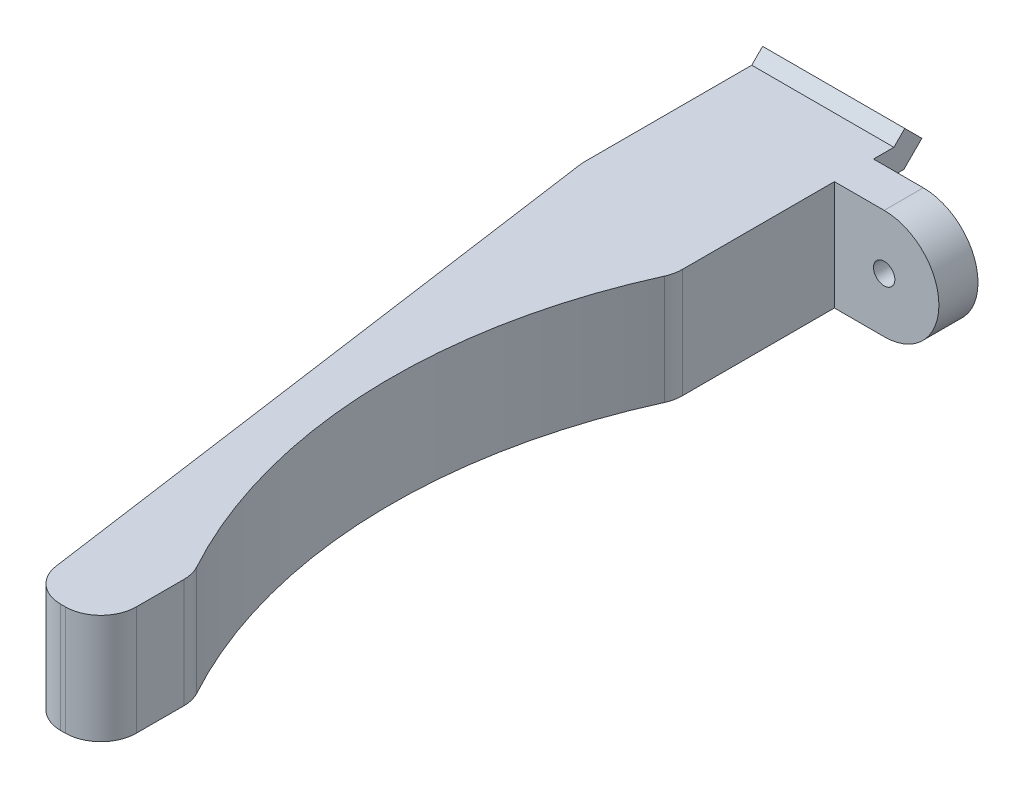
ISO-10303-21;
HEADER;
FILE_DESCRIPTION(('STEP AP214'),'2;1');
FILE_NAME('part.step','',(''),(''),'','','');
FILE_SCHEMA(('AUTOMOTIVE_DESIGN { 1 0 10303 214 1 1 1 1 }'));
ENDSEC;
DATA;
#1=APPLICATION_CONTEXT('core data for automotive mechanical design processes');
#2=APPLICATION_PROTOCOL_DEFINITION('international standard','automotive_design',2000,#1);
#3=PRODUCT_CONTEXT('',#1,'mechanical');
#4=PRODUCT('Part','Part','',(#3));
#5=PRODUCT_RELATED_PRODUCT_CATEGORY('part','',(#4));
#6=PRODUCT_DEFINITION_FORMATION('','',#4);
#7=PRODUCT_DEFINITION_CONTEXT('part definition',#1,'design');
#8=PRODUCT_DEFINITION('design','',#6,#7);
#9=PRODUCT_DEFINITION_SHAPE('','',#8);
#10=(LENGTH_UNIT() NAMED_UNIT(*) SI_UNIT(.MILLI.,.METRE.));
#11=(NAMED_UNIT(*) PLANE_ANGLE_UNIT() SI_UNIT($,.RADIAN.));
#12=(NAMED_UNIT(*) SI_UNIT($,.STERADIAN.) SOLID_ANGLE_UNIT());
#13=UNCERTAINTY_MEASURE_WITH_UNIT(LENGTH_MEASURE(1.E-05),#10,'distance_accuracy_value','');
#14=(GEOMETRIC_REPRESENTATION_CONTEXT(3) GLOBAL_UNCERTAINTY_ASSIGNED_CONTEXT((#13)) GLOBAL_UNIT_ASSIGNED_CONTEXT((#10,
#11,#12)) REPRESENTATION_CONTEXT('',''));
#15=CARTESIAN_POINT('',(0.,0.,0.));
#16=DIRECTION('',(0.,0.,1.));
#17=DIRECTION('',(1.,0.,0.));
#18=AXIS2_PLACEMENT_3D('',#15,#16,#17);
#19=CARTESIAN_POINT('',(5.,-5.8181568544759,5.));
#20=DIRECTION('',(-1.,0.,0.));
#21=DIRECTION('',(0.,0.,1.));
#22=AXIS2_PLACEMENT_3D('',#19,#20,#21);
#23=PLANE('',#22);
#24=DIRECTION('',(0.,0.,1.));
#25=VECTOR('',#24,1.);
#26=CARTESIAN_POINT('',(5.,5.770255584937,-0.149999999997353));
#27=LINE('',#26,#25);
#28=CARTESIAN_POINT('',(5.,5.770255584937,-1.43370490960713));
#29=VERTEX_POINT('',#28);
#30=CARTESIAN_POINT('',(5.,5.770255584937,0.));
#31=VERTEX_POINT('',#30);
#32=EDGE_CURVE('E325',#29,#31,#27,.T.);
#33=ORIENTED_EDGE('',*,*,#32,.T.);
#34=DIRECTION('',(0.,-1.,0.));
#35=VECTOR('',#34,1.);
#36=CARTESIAN_POINT('',(5.,-1.92974441506292,0.));
#37=LINE('',#36,#35);
#38=CARTESIAN_POINT('',(5.,4.07025558493702,0.));
#39=VERTEX_POINT('',#38);
#40=EDGE_CURVE('E213',#31,#39,#37,.T.);
#41=ORIENTED_EDGE('',*,*,#40,.T.);
#42=DIRECTION('',(0.,-1.27213054907211E-13,-1.));
#43=VECTOR('',#42,1.);
#44=CARTESIAN_POINT('',(5.,4.07025558493702,0.));
#45=LINE('',#44,#43);
#46=CARTESIAN_POINT('',(5.,4.070255584937,-2.13786796564139));
#47=VERTEX_POINT('',#46);
#48=EDGE_CURVE('E298',#39,#47,#45,.T.);
#49=ORIENTED_EDGE('',*,*,#48,.T.);
#50=DIRECTION('',(0.,0.707106781186548,-0.707106781186547));
#51=VECTOR('',#50,1.);
#52=CARTESIAN_POINT('',(5.,5.3344691473101,-3.40208152801448));
#53=LINE('',#52,#51);
#54=CARTESIAN_POINT('',(5.,5.3344691473101,-3.40208152801448));
#55=VERTEX_POINT('',#54);
#56=EDGE_CURVE('E296',#47,#55,#53,.T.);
#57=ORIENTED_EDGE('',*,*,#56,.T.);
#58=DIRECTION('',(0.,0.707106781186546,0.707106781186549));
#59=VECTOR('',#58,1.);
#60=CARTESIAN_POINT('',(5.,6.53655067532722,-2.19999999999735));
#61=LINE('',#60,#59);
#62=CARTESIAN_POINT('',(5.,6.53655067532722,-2.19999999999735));
#63=VERTEX_POINT('',#62);
#64=EDGE_CURVE('E293',#55,#63,#61,.T.);
#65=ORIENTED_EDGE('',*,*,#64,.T.);
#66=DIRECTION('',(0.,-0.707106781186548,0.707106781186547));
#67=VECTOR('',#66,1.);
#68=CARTESIAN_POINT('',(5.,5.770255584937,-1.43370490960713));
#69=LINE('',#68,#67);
#70=EDGE_CURVE('E291',#63,#29,#69,.T.);
#71=ORIENTED_EDGE('',*,*,#70,.T.);
#72=EDGE_LOOP('',(#33,#41,#49,#57,#65,#71));
#73=FACE_BOUND('',#72,.T.);
#74=ADVANCED_FACE('F34',(#73),#23,.F.);
#75=DIRECTION('',(0.,0.,1.));
#76=VECTOR('',#75,1.);
#77=CARTESIAN_POINT('',(5.,-0.229744415063001,-0.149999999997353));
#78=LINE('',#77,#76);
#79=CARTESIAN_POINT('',(5.,-0.229744415063001,-1.43370490960713));
#80=VERTEX_POINT('',#79);
#81=CARTESIAN_POINT('',(5.,-0.229744415063001,0.));
#82=VERTEX_POINT('',#81);
#83=EDGE_CURVE('E210',#80,#82,#78,.T.);
#84=ORIENTED_EDGE('',*,*,#83,.T.);
#85=CARTESIAN_POINT('',(5.,-1.92974441506292,0.));
#86=VERTEX_POINT('',#85);
#87=EDGE_CURVE('E207',#82,#86,#37,.T.);
#88=ORIENTED_EDGE('',*,*,#87,.T.);
#89=DIRECTION('',(0.,0.,-1.));
#90=VECTOR('',#89,1.);
#91=CARTESIAN_POINT('',(5.,-1.929744415063,-0.149999999997353));
#92=LINE('',#91,#90);
#93=CARTESIAN_POINT('',(5.,-1.929744415063,-2.13786796564139));
#94=VERTEX_POINT('',#93);
#95=EDGE_CURVE('E190',#86,#94,#92,.T.);
#96=ORIENTED_EDGE('',*,*,#95,.T.);
#97=DIRECTION('',(0.,0.707106781186549,-0.707106781186546));
#98=VECTOR('',#97,1.);
#99=CARTESIAN_POINT('',(5.,-0.665530852689905,-3.40208152801448));
#100=LINE('',#99,#98);
#101=CARTESIAN_POINT('',(5.,-0.665530852689905,-3.40208152801448));
#102=VERTEX_POINT('',#101);
#103=EDGE_CURVE('E203',#94,#102,#100,.T.);
#104=ORIENTED_EDGE('',*,*,#103,.T.);
#105=DIRECTION('',(0.,0.707106781186548,0.707106781186548));
#106=VECTOR('',#105,1.);
#107=CARTESIAN_POINT('',(5.,0.536550675327224,-2.19999999999735));
#108=LINE('',#107,#106);
#109=CARTESIAN_POINT('',(5.,0.536550675327225,-2.19999999999735));
#110=VERTEX_POINT('',#109);
#111=EDGE_CURVE('E264',#102,#110,#108,.T.);
#112=ORIENTED_EDGE('',*,*,#111,.T.);
#113=DIRECTION('',(0.,-0.707106781186546,0.707106781186549));
#114=VECTOR('',#113,1.);
#115=CARTESIAN_POINT('',(5.,-0.229744415063001,-1.43370490960713));
#116=LINE('',#115,#114);
#117=EDGE_CURVE('E262',#110,#80,#116,.T.);
#118=ORIENTED_EDGE('',*,*,#117,.T.);
#119=EDGE_LOOP('',(#84,#88,#96,#104,#112,#118));
#120=FACE_BOUND('',#119,.T.);
#121=ADVANCED_FACE('F208',(#120),#23,.F.);
#122=CARTESIAN_POINT('',(5.,5.770255584937,2.75000000000266));
#123=VERTEX_POINT('',#122);
#124=CARTESIAN_POINT('',(5.,5.770255584937,13.4501334916828));
#125=VERTEX_POINT('',#124);
#126=EDGE_CURVE('E300',#123,#125,#27,.T.);
#127=ORIENTED_EDGE('',*,*,#126,.T.);
#128=DIRECTION('',(0.,-1.,0.));
#129=VECTOR('',#128,1.);
#130=CARTESIAN_POINT('',(5.,-1.92974441506298,13.4501334916828));
#131=LINE('',#130,#129);
#132=CARTESIAN_POINT('',(5.,-1.92974441506298,13.4501334916828));
#133=VERTEX_POINT('',#132);
#134=EDGE_CURVE('E354',#125,#133,#131,.T.);
#135=ORIENTED_EDGE('',*,*,#134,.T.);
#136=CARTESIAN_POINT('',(5.,-1.929744415063,2.75000000000266));
#137=VERTEX_POINT('',#136);
#138=EDGE_CURVE('E202',#133,#137,#92,.T.);
#139=ORIENTED_EDGE('',*,*,#138,.T.);
#140=DIRECTION('',(0.,-1.,0.));
#141=VECTOR('',#140,1.);
#142=CARTESIAN_POINT('',(5.,-1.92974441506292,2.75000000000266));
#143=LINE('',#142,#141);
#144=EDGE_CURVE('E418',#123,#137,#143,.T.);
#145=ORIENTED_EDGE('',*,*,#144,.F.);
#146=EDGE_LOOP('',(#127,#135,#139,#145));
#147=FACE_BOUND('',#146,.T.);
#148=ADVANCED_FACE('F443',(#147),#23,.F.);
#149=CARTESIAN_POINT('',(-5.,-5.8181568544759,5.));
#150=DIRECTION('',(1.,0.,0.));
#151=DIRECTION('',(0.,0.,-1.));
#152=AXIS2_PLACEMENT_3D('',#149,#150,#151);
#153=PLANE('',#152);
#154=DIRECTION('',(0.,0.,1.));
#155=VECTOR('',#154,1.);
#156=CARTESIAN_POINT('',(-5.,-1.929744415063,-0.149999999997353));
#157=LINE('',#156,#155);
#158=CARTESIAN_POINT('',(-5.,-1.929744415063,-2.13786796564139));
#159=VERTEX_POINT('',#158);
#160=CARTESIAN_POINT('',(-5.,-1.92974441506299,10.5));
#161=VERTEX_POINT('',#160);
#162=EDGE_CURVE('E278',#159,#161,#157,.T.);
#163=ORIENTED_EDGE('',*,*,#162,.T.);
#164=DIRECTION('',(0.,1.,0.));
#165=VECTOR('',#164,1.);
#166=CARTESIAN_POINT('',(-5.,-53.8851870945324,10.5));
#167=LINE('',#166,#165);
#168=CARTESIAN_POINT('',(-5.,5.770255584937,10.5));
#169=VERTEX_POINT('',#168);
#170=EDGE_CURVE('E257',#161,#169,#167,.T.);
#171=ORIENTED_EDGE('',*,*,#170,.T.);
#172=DIRECTION('',(0.,0.,-1.));
#173=VECTOR('',#172,1.);
#174=CARTESIAN_POINT('',(-5.,5.770255584937,-0.149999999997353));
#175=LINE('',#174,#173);
#176=CARTESIAN_POINT('',(-5.,5.770255584937,-1.43370490960713));
#177=VERTEX_POINT('',#176);
#178=EDGE_CURVE('E290',#169,#177,#175,.T.);
#179=ORIENTED_EDGE('',*,*,#178,.T.);
#180=DIRECTION('',(0.,0.707106781186548,-0.707106781186547));
#181=VECTOR('',#180,1.);
#182=CARTESIAN_POINT('',(-5.,5.770255584937,-1.43370490960713));
#183=LINE('',#182,#181);
#184=CARTESIAN_POINT('',(-5.,6.53655067532722,-2.19999999999735));
#185=VERTEX_POINT('',#184);
#186=EDGE_CURVE('E303',#177,#185,#183,.T.);
#187=ORIENTED_EDGE('',*,*,#186,.T.);
#188=DIRECTION('',(0.,-0.707106781186546,-0.707106781186549));
#189=VECTOR('',#188,1.);
#190=CARTESIAN_POINT('',(-5.,6.53655067532722,-2.19999999999735));
#191=LINE('',#190,#189);
#192=CARTESIAN_POINT('',(-5.,5.3344691473101,-3.40208152801448));
#193=VERTEX_POINT('',#192);
#194=EDGE_CURVE('E306',#185,#193,#191,.T.);
#195=ORIENTED_EDGE('',*,*,#194,.T.);
#196=DIRECTION('',(0.,-0.707106781186548,0.707106781186547));
#197=VECTOR('',#196,1.);
#198=CARTESIAN_POINT('',(-5.,5.3344691473101,-3.40208152801448));
#199=LINE('',#198,#197);
#200=CARTESIAN_POINT('',(-5.,4.070255584937,-2.13786796564139));
#201=VERTEX_POINT('',#200);
#202=EDGE_CURVE('E309',#193,#201,#199,.T.);
#203=ORIENTED_EDGE('',*,*,#202,.T.);
#204=DIRECTION('',(0.,1.27213054907211E-13,1.));
#205=VECTOR('',#204,1.);
#206=CARTESIAN_POINT('',(-5.,4.07025558493702,0.));
#207=LINE('',#206,#205);
#208=CARTESIAN_POINT('',(-5.,4.07025558493702,0.));
#209=VERTEX_POINT('',#208);
#210=EDGE_CURVE('E312',#201,#209,#207,.T.);
#211=ORIENTED_EDGE('',*,*,#210,.T.);
#212=DIRECTION('',(0.,-1.,0.));
#213=VECTOR('',#212,1.);
#214=CARTESIAN_POINT('',(-5.,-5.8181568544759,0.));
#215=LINE('',#214,#213);
#216=CARTESIAN_POINT('',(-5.,-0.229744415063002,0.));
#217=VERTEX_POINT('',#216);
#218=EDGE_CURVE('E327',#209,#217,#215,.T.);
#219=ORIENTED_EDGE('',*,*,#218,.T.);
#220=DIRECTION('',(0.,0.,-1.));
#221=VECTOR('',#220,1.);
#222=CARTESIAN_POINT('',(-5.,-0.229744415063001,-0.149999999997353));
#223=LINE('',#222,#221);
#224=CARTESIAN_POINT('',(-5.,-0.229744415063001,-1.43370490960713));
#225=VERTEX_POINT('',#224);
#226=EDGE_CURVE('E254',#217,#225,#223,.T.);
#227=ORIENTED_EDGE('',*,*,#226,.T.);
#228=DIRECTION('',(0.,0.707106781186546,-0.707106781186549));
#229=VECTOR('',#228,1.);
#230=CARTESIAN_POINT('',(-5.,-0.229744415063001,-1.43370490960713));
#231=LINE('',#230,#229);
#232=CARTESIAN_POINT('',(-5.,0.536550675327224,-2.19999999999735));
#233=VERTEX_POINT('',#232);
#234=EDGE_CURVE('E269',#225,#233,#231,.T.);
#235=ORIENTED_EDGE('',*,*,#234,.T.);
#236=DIRECTION('',(0.,-0.707106781186548,-0.707106781186548));
#237=VECTOR('',#236,1.);
#238=CARTESIAN_POINT('',(-5.,0.536550675327224,-2.19999999999735));
#239=LINE('',#238,#237);
#240=CARTESIAN_POINT('',(-5.,-0.665530852689905,-3.40208152801448));
#241=VERTEX_POINT('',#240);
#242=EDGE_CURVE('E272',#233,#241,#239,.T.);
#243=ORIENTED_EDGE('',*,*,#242,.T.);
#244=DIRECTION('',(0.,-0.707106781186549,0.707106781186546));
#245=VECTOR('',#244,1.);
#246=CARTESIAN_POINT('',(-5.,-0.665530852689905,-3.40208152801448));
#247=LINE('',#246,#245);
#248=EDGE_CURVE('E275',#241,#159,#247,.T.);
#249=ORIENTED_EDGE('',*,*,#248,.T.);
#250=EDGE_LOOP('',(#163,#171,#179,#187,#195,#203,#211,#219,#227,#235,#243,#249));
#251=FACE_BOUND('',#250,.T.);
#252=ADVANCED_FACE('F375',(#251),#153,.F.);
#253=CARTESIAN_POINT('',(0.,0.,0.));
#254=DIRECTION('',(0.,0.,-1.));
#255=DIRECTION('',(-1.,0.,0.));
#256=AXIS2_PLACEMENT_3D('',#253,#254,#255);
#257=PLANE('',#256);
#258=DIRECTION('',(-1.,0.,0.));
#259=VECTOR('',#258,1.);
#260=CARTESIAN_POINT('',(9.20199597764447,-0.229744415063002,0.));
#261=LINE('',#260,#259);
#262=EDGE_CURVE('E280',#82,#217,#261,.T.);
#263=ORIENTED_EDGE('',*,*,#262,.T.);
#264=ORIENTED_EDGE('',*,*,#218,.F.);
#265=DIRECTION('',(-1.,0.,0.));
#266=VECTOR('',#265,1.);
#267=CARTESIAN_POINT('',(9.20199597764447,4.07025558493702,0.));
#268=LINE('',#267,#266);
#269=EDGE_CURVE('E294',#39,#209,#268,.T.);
#270=ORIENTED_EDGE('',*,*,#269,.F.);
#271=ORIENTED_EDGE('',*,*,#40,.F.);
#272=DIRECTION('',(-1.,0.,0.));
#273=VECTOR('',#272,1.);
#274=CARTESIAN_POINT('',(5.,5.77025558493708,0.));
#275=LINE('',#274,#273);
#276=CARTESIAN_POINT('',(8.5,5.77025558493708,0.));
#277=VERTEX_POINT('',#276);
#278=EDGE_CURVE('E222',#277,#31,#275,.T.);
#279=ORIENTED_EDGE('',*,*,#278,.F.);
#280=CARTESIAN_POINT('',(8.5,1.92025558493704,0.));
#281=DIRECTION('',(0.,0.,1.));
#282=DIRECTION('',(-1.,0.,0.));
#283=AXIS2_PLACEMENT_3D('',#280,#281,#282);
#284=CIRCLE('',#283,3.85);
#285=CARTESIAN_POINT('',(8.5,-1.92974441506296,0.));
#286=VERTEX_POINT('',#285);
#287=EDGE_CURVE('E220',#286,#277,#284,.T.);
#288=ORIENTED_EDGE('',*,*,#287,.F.);
#289=DIRECTION('',(1.,0.,0.));
#290=VECTOR('',#289,1.);
#291=CARTESIAN_POINT('',(8.5,-1.92974441506292,0.));
#292=LINE('',#291,#290);
#293=EDGE_CURVE('E196',#86,#286,#292,.T.);
#294=ORIENTED_EDGE('',*,*,#293,.F.);
#295=ORIENTED_EDGE('',*,*,#87,.F.);
#296=EDGE_LOOP('',(#263,#264,#270,#271,#279,#288,#294,#295));
#297=FACE_BOUND('',#296,.T.);
#298=CARTESIAN_POINT('',(8.5,1.92025558493704,0.));
#299=DIRECTION('',(0.,0.,1.));
#300=DIRECTION('',(1.,0.,0.));
#301=AXIS2_PLACEMENT_3D('',#298,#299,#300);
#302=CIRCLE('',#301,0.750000000002417);
#303=CARTESIAN_POINT('',(9.25000000000242,1.92025558493704,0.));
#304=VERTEX_POINT('',#303);
#305=EDGE_CURVE('E214',#304,#304,#302,.T.);
#306=ORIENTED_EDGE('',*,*,#305,.T.);
#307=EDGE_LOOP('',(#306));
#308=FACE_BOUND('',#307,.T.);
#309=ADVANCED_FACE('F216',(#297,#308),#257,.T.);
#310=CARTESIAN_POINT('',(9.20199597764447,4.07025558493702,0.));
#311=DIRECTION('',(0.,-1.,1.27213054907211E-13));
#312=DIRECTION('',(0.,-1.27213054907211E-13,-1.));
#313=AXIS2_PLACEMENT_3D('',#310,#311,#312);
#314=PLANE('',#313);
#315=ORIENTED_EDGE('',*,*,#48,.F.);
#316=ORIENTED_EDGE('',*,*,#269,.T.);
#317=ORIENTED_EDGE('',*,*,#210,.F.);
#318=DIRECTION('',(-1.,0.,0.));
#319=VECTOR('',#318,1.);
#320=CARTESIAN_POINT('',(9.20199597764447,4.070255584937,-2.13786796564139));
#321=LINE('',#320,#319);
#322=EDGE_CURVE('E318',#47,#201,#321,.T.);
#323=ORIENTED_EDGE('',*,*,#322,.F.);
#324=EDGE_LOOP('',(#315,#316,#317,#323));
#325=FACE_BOUND('',#324,.T.);
#326=ADVANCED_FACE('F397',(#325),#314,.T.);
#327=CARTESIAN_POINT('',(9.20199597764447,5.3344691473101,-3.40208152801448));
#328=DIRECTION('',(0.,-0.707106781186547,-0.707106781186548));
#329=DIRECTION('',(0.,0.707106781186548,-0.707106781186547));
#330=AXIS2_PLACEMENT_3D('',#327,#328,#329);
#331=PLANE('',#330);
#332=ORIENTED_EDGE('',*,*,#56,.F.);
#333=ORIENTED_EDGE('',*,*,#322,.T.);
#334=ORIENTED_EDGE('',*,*,#202,.F.);
#335=DIRECTION('',(-1.,0.,0.));
#336=VECTOR('',#335,1.);
#337=CARTESIAN_POINT('',(9.20199597764447,5.3344691473101,-3.40208152801448));
#338=LINE('',#337,#336);
#339=EDGE_CURVE('E320',#55,#193,#338,.T.);
#340=ORIENTED_EDGE('',*,*,#339,.F.);
#341=EDGE_LOOP('',(#332,#333,#334,#340));
#342=FACE_BOUND('',#341,.T.);
#343=ADVANCED_FACE('F580',(#342),#331,.T.);
#344=CARTESIAN_POINT('',(9.20199597764447,6.53655067532722,-2.19999999999735));
#345=DIRECTION('',(0.,0.707106781186549,-0.707106781186546));
#346=DIRECTION('',(0.,0.707106781186546,0.707106781186549));
#347=AXIS2_PLACEMENT_3D('',#344,#345,#346);
#348=PLANE('',#347);
#349=ORIENTED_EDGE('',*,*,#64,.F.);
#350=ORIENTED_EDGE('',*,*,#339,.T.);
#351=ORIENTED_EDGE('',*,*,#194,.F.);
#352=DIRECTION('',(-1.,0.,0.));
#353=VECTOR('',#352,1.);
#354=CARTESIAN_POINT('',(9.20199597764447,6.53655067532722,-2.19999999999735));
#355=LINE('',#354,#353);
#356=EDGE_CURVE('E322',#63,#185,#355,.T.);
#357=ORIENTED_EDGE('',*,*,#356,.F.);
#358=EDGE_LOOP('',(#349,#350,#351,#357));
#359=FACE_BOUND('',#358,.T.);
#360=ADVANCED_FACE('F641',(#359),#348,.T.);
#361=CARTESIAN_POINT('',(9.20199597764447,5.770255584937,-1.43370490960713));
#362=DIRECTION('',(0.,0.707106781186547,0.707106781186548));
#363=DIRECTION('',(0.,-0.707106781186548,0.707106781186547));
#364=AXIS2_PLACEMENT_3D('',#361,#362,#363);
#365=PLANE('',#364);
#366=ORIENTED_EDGE('',*,*,#70,.F.);
#367=ORIENTED_EDGE('',*,*,#356,.T.);
#368=ORIENTED_EDGE('',*,*,#186,.F.);
#369=DIRECTION('',(-1.,0.,0.));
#370=VECTOR('',#369,1.);
#371=CARTESIAN_POINT('',(9.20199597764447,5.770255584937,-1.43370490960713));
#372=LINE('',#371,#370);
#373=EDGE_CURVE('E315',#29,#177,#372,.T.);
#374=ORIENTED_EDGE('',*,*,#373,.F.);
#375=EDGE_LOOP('',(#366,#367,#368,#374));
#376=FACE_BOUND('',#375,.T.);
#377=ADVANCED_FACE('F535',(#376),#365,.T.);
#378=CARTESIAN_POINT('',(9.20199597764447,5.770255584937,-0.149999999997353));
#379=DIRECTION('',(0.,1.,0.));
#380=DIRECTION('',(0.,0.,1.));
#381=AXIS2_PLACEMENT_3D('',#378,#379,#380);
#382=PLANE('',#381);
#383=DIRECTION('',(0.,0.,-1.));
#384=VECTOR('',#383,1.);
#385=CARTESIAN_POINT('',(6.35244572854812,5.770255584937,55.7));
#386=LINE('',#385,#384);
#387=CARTESIAN_POINT('',(6.35244572854812,5.770255584937,53.2));
#388=VERTEX_POINT('',#387);
#389=CARTESIAN_POINT('',(6.35244572854812,5.770255584937,49.8497116646296));
#390=VERTEX_POINT('',#389);
#391=EDGE_CURVE('E244',#388,#390,#386,.T.);
#392=ORIENTED_EDGE('',*,*,#391,.T.);
#393=CARTESIAN_POINT('',(3.85244572854812,5.770255584937,49.8497116646296));
#394=DIRECTION('',(0.,1.,0.));
#395=DIRECTION('',(0.,0.,1.));
#396=AXIS2_PLACEMENT_3D('',#393,#394,#395);
#397=CIRCLE('',#396,2.5);
#398=CARTESIAN_POINT('',(6.04589541498279,5.770255584937,48.6502207421631));
#399=VERTEX_POINT('',#398);
#400=EDGE_CURVE('E341',#390,#399,#397,.T.);
#401=ORIENTED_EDGE('',*,*,#400,.T.);
#402=CARTESIAN_POINT('',(39.6088986863946,5.770255584937,30.2962470888115));
#403=DIRECTION('',(0.,-1.,0.));
#404=DIRECTION('',(0.,0.,1.));
#405=AXIS2_PLACEMENT_3D('',#402,#403,#404);
#406=CIRCLE('',#405,38.2536735159477);
#407=CARTESIAN_POINT('',(4.77641433795368,5.770255584937,14.4835442338173));
#408=VERTEX_POINT('',#407);
#409=EDGE_CURVE('E241',#399,#408,#406,.T.);
#410=ORIENTED_EDGE('',*,*,#409,.T.);
#411=CARTESIAN_POINT('',(2.5,5.770255584937,13.4501334916828));
#412=DIRECTION('',(0.,1.,0.));
#413=DIRECTION('',(0.,0.,1.));
#414=AXIS2_PLACEMENT_3D('',#411,#412,#413);
#415=CIRCLE('',#414,2.5);
#416=EDGE_CURVE('E339',#408,#125,#415,.T.);
#417=ORIENTED_EDGE('',*,*,#416,.T.);
#418=ORIENTED_EDGE('',*,*,#126,.F.);
#419=DIRECTION('',(-1.,0.,0.));
#420=VECTOR('',#419,1.);
#421=CARTESIAN_POINT('',(5.,5.77025558493708,2.75000000000266));
#422=LINE('',#421,#420);
#423=CARTESIAN_POINT('',(8.5,5.77025558493708,2.75000000000266));
#424=VERTEX_POINT('',#423);
#425=EDGE_CURVE('E236',#424,#123,#422,.T.);
#426=ORIENTED_EDGE('',*,*,#425,.F.);
#427=DIRECTION('',(0.,0.,-1.));
#428=VECTOR('',#427,1.);
#429=CARTESIAN_POINT('',(8.5,5.77025558493708,13.3948344280246));
#430=LINE('',#429,#428);
#431=EDGE_CURVE('E228',#424,#277,#430,.T.);
#432=ORIENTED_EDGE('',*,*,#431,.T.);
#433=ORIENTED_EDGE('',*,*,#278,.T.);
#434=ORIENTED_EDGE('',*,*,#32,.F.);
#435=ORIENTED_EDGE('',*,*,#373,.T.);
#436=ORIENTED_EDGE('',*,*,#178,.F.);
#437=DIRECTION('',(0.139173100960066,0.,0.99026806874157));
#438=VECTOR('',#437,1.);
#439=CARTESIAN_POINT('',(-5.,5.770255584937,10.5));
#440=LINE('',#439,#438);
#441=CARTESIAN_POINT('',(1.04999240123476,5.770255584937,53.5479327524002));
#442=VERTEX_POINT('',#441);
#443=EDGE_CURVE('E237',#169,#442,#440,.T.);
#444=ORIENTED_EDGE('',*,*,#443,.T.);
#445=CARTESIAN_POINT('',(3.52566257308868,5.770255584937,53.2));
#446=DIRECTION('',(0.,1.,0.));
#447=DIRECTION('',(0.,0.,1.));
#448=AXIS2_PLACEMENT_3D('',#445,#446,#447);
#449=CIRCLE('',#448,2.5);
#450=CARTESIAN_POINT('',(3.52566257308868,5.770255584937,55.7));
#451=VERTEX_POINT('',#450);
#452=EDGE_CURVE('E335',#442,#451,#449,.T.);
#453=ORIENTED_EDGE('',*,*,#452,.T.);
#454=DIRECTION('',(1.,0.,0.));
#455=VECTOR('',#454,1.);
#456=CARTESIAN_POINT('',(1.35244572854812,5.770255584937,55.7));
#457=LINE('',#456,#455);
#458=CARTESIAN_POINT('',(3.85244572854812,5.770255584937,55.7));
#459=VERTEX_POINT('',#458);
#460=EDGE_CURVE('E232',#451,#459,#457,.T.);
#461=ORIENTED_EDGE('',*,*,#460,.T.);
#462=CARTESIAN_POINT('',(3.85244572854812,5.770255584937,53.2));
#463=DIRECTION('',(0.,1.,0.));
#464=DIRECTION('',(0.,0.,1.));
#465=AXIS2_PLACEMENT_3D('',#462,#463,#464);
#466=CIRCLE('',#465,2.5);
#467=EDGE_CURVE('E337',#459,#388,#466,.T.);
#468=ORIENTED_EDGE('',*,*,#467,.T.);
#469=EDGE_LOOP('',(#392,#401,#410,#417,#418,#426,#432,#433,#434,#435,#436,#444,#453,#461,#468));
#470=FACE_BOUND('',#469,.T.);
#471=ADVANCED_FACE('F365',(#470),#382,.T.);
#472=CARTESIAN_POINT('',(9.20199597764447,-1.929744415063,-0.149999999997353));
#473=DIRECTION('',(0.,-1.,0.));
#474=DIRECTION('',(0.,0.,-1.));
#475=AXIS2_PLACEMENT_3D('',#472,#473,#474);
#476=PLANE('',#475);
#477=CARTESIAN_POINT('',(39.6088986863946,-1.92974441506296,30.2962470888115));
#478=DIRECTION('',(0.,-1.,0.));
#479=DIRECTION('',(0.,0.,-1.));
#480=AXIS2_PLACEMENT_3D('',#477,#478,#479);
#481=CIRCLE('',#480,38.2536735159477);
#482=CARTESIAN_POINT('',(6.04589541498279,-1.92974441506293,48.6502207421631));
#483=VERTEX_POINT('',#482);
#484=CARTESIAN_POINT('',(4.77641433795368,-1.92974441506298,14.4835442338173));
#485=VERTEX_POINT('',#484);
#486=EDGE_CURVE('E251',#483,#485,#481,.T.);
#487=ORIENTED_EDGE('',*,*,#486,.F.);
#488=CARTESIAN_POINT('',(3.85244572854812,-1.92974441506293,49.8497116646296));
#489=DIRECTION('',(0.,-1.,0.));
#490=DIRECTION('',(0.,0.,-1.));
#491=AXIS2_PLACEMENT_3D('',#488,#489,#490);
#492=CIRCLE('',#491,2.5);
#493=CARTESIAN_POINT('',(6.35244572854812,-1.92974441506293,49.8497116646296));
#494=VERTEX_POINT('',#493);
#495=EDGE_CURVE('E352',#483,#494,#492,.T.);
#496=ORIENTED_EDGE('',*,*,#495,.T.);
#497=DIRECTION('',(0.,0.,-1.));
#498=VECTOR('',#497,1.);
#499=CARTESIAN_POINT('',(6.35244572854812,-1.92974441506292,55.6999999999999));
#500=LINE('',#499,#498);
#501=CARTESIAN_POINT('',(6.35244572854812,-1.92974441506292,53.2));
#502=VERTEX_POINT('',#501);
#503=EDGE_CURVE('E240',#502,#494,#500,.T.);
#504=ORIENTED_EDGE('',*,*,#503,.F.);
#505=CARTESIAN_POINT('',(3.85244572854812,-1.92974441506293,53.2));
#506=DIRECTION('',(0.,-1.,0.));
#507=DIRECTION('',(0.,0.,-1.));
#508=AXIS2_PLACEMENT_3D('',#505,#506,#507);
#509=CIRCLE('',#508,2.5);
#510=CARTESIAN_POINT('',(3.85244572854812,-1.92974441506292,55.7));
#511=VERTEX_POINT('',#510);
#512=EDGE_CURVE('E55',#502,#511,#509,.T.);
#513=ORIENTED_EDGE('',*,*,#512,.T.);
#514=DIRECTION('',(1.,0.,0.));
#515=VECTOR('',#514,1.);
#516=CARTESIAN_POINT('',(1.35244572854812,-1.92974441506292,55.7));
#517=LINE('',#516,#515);
#518=CARTESIAN_POINT('',(3.52566257308868,-1.92974441506292,55.7));
#519=VERTEX_POINT('',#518);
#520=EDGE_CURVE('E252',#519,#511,#517,.T.);
#521=ORIENTED_EDGE('',*,*,#520,.F.);
#522=CARTESIAN_POINT('',(3.52566257308868,-1.92974441506293,53.2));
#523=DIRECTION('',(0.,-1.,0.));
#524=DIRECTION('',(0.,0.,-1.));
#525=AXIS2_PLACEMENT_3D('',#522,#523,#524);
#526=CIRCLE('',#525,2.5);
#527=CARTESIAN_POINT('',(1.04999240123476,-1.92974441506293,53.5479327524002));
#528=VERTEX_POINT('',#527);
#529=EDGE_CURVE('E49',#519,#528,#526,.T.);
#530=ORIENTED_EDGE('',*,*,#529,.T.);
#531=DIRECTION('',(0.139173100960066,0.,0.99026806874157));
#532=VECTOR('',#531,1.);
#533=CARTESIAN_POINT('',(-5.00000000000001,-1.92974441506299,10.4999999999999));
#534=LINE('',#533,#532);
#535=EDGE_CURVE('E255',#161,#528,#534,.T.);
#536=ORIENTED_EDGE('',*,*,#535,.F.);
#537=ORIENTED_EDGE('',*,*,#162,.F.);
#538=DIRECTION('',(-1.,0.,0.));
#539=VECTOR('',#538,1.);
#540=CARTESIAN_POINT('',(9.20199597764447,-1.929744415063,-2.13786796564139));
#541=LINE('',#540,#539);
#542=EDGE_CURVE('E199',#94,#159,#541,.T.);
#543=ORIENTED_EDGE('',*,*,#542,.F.);
#544=ORIENTED_EDGE('',*,*,#95,.F.);
#545=ORIENTED_EDGE('',*,*,#293,.T.);
#546=DIRECTION('',(0.,0.,-1.));
#547=VECTOR('',#546,1.);
#548=CARTESIAN_POINT('',(8.5,-1.92974441506296,13.3948344280246));
#549=LINE('',#548,#547);
#550=CARTESIAN_POINT('',(8.5,-1.92974441506296,2.75000000000266));
#551=VERTEX_POINT('',#550);
#552=EDGE_CURVE('E230',#551,#286,#549,.T.);
#553=ORIENTED_EDGE('',*,*,#552,.F.);
#554=DIRECTION('',(1.,0.,0.));
#555=VECTOR('',#554,1.);
#556=CARTESIAN_POINT('',(8.5,-1.92974441506292,2.75000000000266));
#557=LINE('',#556,#555);
#558=EDGE_CURVE('E414',#137,#551,#557,.T.);
#559=ORIENTED_EDGE('',*,*,#558,.F.);
#560=ORIENTED_EDGE('',*,*,#138,.F.);
#561=CARTESIAN_POINT('',(2.5,-1.92974441506298,13.4501334916828));
#562=DIRECTION('',(0.,-1.,0.));
#563=DIRECTION('',(0.,0.,-1.));
#564=AXIS2_PLACEMENT_3D('',#561,#562,#563);
#565=CIRCLE('',#564,2.5);
#566=EDGE_CURVE('E350',#133,#485,#565,.T.);
#567=ORIENTED_EDGE('',*,*,#566,.T.);
#568=EDGE_LOOP('',(#487,#496,#504,#513,#521,#530,#536,#537,#543,#544,#545,#553,#559,#560,#567));
#569=FACE_BOUND('',#568,.T.);
#570=ADVANCED_FACE('F193',(#569),#476,.T.);
#571=CARTESIAN_POINT('',(9.20199597764447,-0.665530852689905,-3.40208152801448));
#572=DIRECTION('',(0.,-0.707106781186546,-0.707106781186549));
#573=DIRECTION('',(0.,0.707106781186549,-0.707106781186546));
#574=AXIS2_PLACEMENT_3D('',#571,#572,#573);
#575=PLANE('',#574);
#576=ORIENTED_EDGE('',*,*,#103,.F.);
#577=ORIENTED_EDGE('',*,*,#542,.T.);
#578=ORIENTED_EDGE('',*,*,#248,.F.);
#579=DIRECTION('',(-1.,0.,0.));
#580=VECTOR('',#579,1.);
#581=CARTESIAN_POINT('',(9.20199597764447,-0.665530852689905,-3.40208152801448));
#582=LINE('',#581,#580);
#583=EDGE_CURVE('E282',#102,#241,#582,.T.);
#584=ORIENTED_EDGE('',*,*,#583,.F.);
#585=EDGE_LOOP('',(#576,#577,#578,#584));
#586=FACE_BOUND('',#585,.T.);
#587=ADVANCED_FACE('F379',(#586),#575,.T.);
#588=CARTESIAN_POINT('',(9.20199597764447,0.536550675327224,-2.19999999999735));
#589=DIRECTION('',(0.,0.707106781186547,-0.707106781186547));
#590=DIRECTION('',(0.,0.707106781186548,0.707106781186548));
#591=AXIS2_PLACEMENT_3D('',#588,#589,#590);
#592=PLANE('',#591);
#593=ORIENTED_EDGE('',*,*,#111,.F.);
#594=ORIENTED_EDGE('',*,*,#583,.T.);
#595=ORIENTED_EDGE('',*,*,#242,.F.);
#596=DIRECTION('',(-1.,0.,0.));
#597=VECTOR('',#596,1.);
#598=CARTESIAN_POINT('',(9.20199597764447,0.536550675327224,-2.19999999999735));
#599=LINE('',#598,#597);
#600=EDGE_CURVE('E284',#110,#233,#599,.T.);
#601=ORIENTED_EDGE('',*,*,#600,.F.);
#602=EDGE_LOOP('',(#593,#594,#595,#601));
#603=FACE_BOUND('',#602,.T.);
#604=ADVANCED_FACE('F384',(#603),#592,.T.);
#605=CARTESIAN_POINT('',(9.20199597764447,-0.229744415063001,-1.43370490960713));
#606=DIRECTION('',(0.,0.707106781186549,0.707106781186546));
#607=DIRECTION('',(0.,-0.707106781186546,0.707106781186549));
#608=AXIS2_PLACEMENT_3D('',#605,#606,#607);
#609=PLANE('',#608);
#610=ORIENTED_EDGE('',*,*,#117,.F.);
#611=ORIENTED_EDGE('',*,*,#600,.T.);
#612=ORIENTED_EDGE('',*,*,#234,.F.);
#613=DIRECTION('',(-1.,0.,0.));
#614=VECTOR('',#613,1.);
#615=CARTESIAN_POINT('',(9.20199597764447,-0.229744415063001,-1.43370490960713));
#616=LINE('',#615,#614);
#617=EDGE_CURVE('E286',#80,#225,#616,.T.);
#618=ORIENTED_EDGE('',*,*,#617,.F.);
#619=EDGE_LOOP('',(#610,#611,#612,#618));
#620=FACE_BOUND('',#619,.T.);
#621=ADVANCED_FACE('F387',(#620),#609,.T.);
#622=CARTESIAN_POINT('',(9.20199597764447,-0.229744415063001,-0.149999999997353));
#623=DIRECTION('',(0.,1.,0.));
#624=DIRECTION('',(0.,0.,1.));
#625=AXIS2_PLACEMENT_3D('',#622,#623,#624);
#626=PLANE('',#625);
#627=ORIENTED_EDGE('',*,*,#83,.F.);
#628=ORIENTED_EDGE('',*,*,#617,.T.);
#629=ORIENTED_EDGE('',*,*,#226,.F.);
#630=ORIENTED_EDGE('',*,*,#262,.F.);
#631=EDGE_LOOP('',(#627,#628,#629,#630));
#632=FACE_BOUND('',#631,.T.);
#633=ADVANCED_FACE('F390',(#632),#626,.T.);
#634=CARTESIAN_POINT('',(6.35244572854812,-53.8851870945324,55.7));
#635=DIRECTION('',(1.,0.,0.));
#636=DIRECTION('',(0.,0.,-1.));
#637=AXIS2_PLACEMENT_3D('',#634,#635,#636);
#638=PLANE('',#637);
#639=ORIENTED_EDGE('',*,*,#503,.T.);
#640=DIRECTION('',(0.,1.,0.));
#641=VECTOR('',#640,1.);
#642=CARTESIAN_POINT('',(6.35244572854812,-53.8851870945324,49.8497116646296));
#643=LINE('',#642,#641);
#644=EDGE_CURVE('E332',#494,#390,#643,.T.);
#645=ORIENTED_EDGE('',*,*,#644,.T.);
#646=ORIENTED_EDGE('',*,*,#391,.F.);
#647=DIRECTION('',(0.,1.,0.));
#648=VECTOR('',#647,1.);
#649=CARTESIAN_POINT('',(6.35244572854812,-53.8851870945324,53.2));
#650=LINE('',#649,#648);
#651=EDGE_CURVE('E330',#388,#502,#650,.F.);
#652=ORIENTED_EDGE('',*,*,#651,.T.);
#653=EDGE_LOOP('',(#639,#645,#646,#652));
#654=FACE_BOUND('',#653,.T.);
#655=ADVANCED_FACE('F465',(#654),#638,.T.);
#656=CARTESIAN_POINT('',(39.6088986863946,-53.8851870945324,30.2962470888115));
#657=DIRECTION('',(0.,1.,0.));
#658=DIRECTION('',(0.,0.,1.));
#659=AXIS2_PLACEMENT_3D('',#656,#657,#658);
#660=CYLINDRICAL_SURFACE('',#659,38.2536735159477);
#661=ORIENTED_EDGE('',*,*,#409,.F.);
#662=DIRECTION('',(0.,1.,0.));
#663=VECTOR('',#662,1.);
#664=CARTESIAN_POINT('',(6.04589541498279,-53.8851870945324,48.6502207421631));
#665=LINE('',#664,#663);
#666=EDGE_CURVE('E346',#399,#483,#665,.F.);
#667=ORIENTED_EDGE('',*,*,#666,.T.);
#668=ORIENTED_EDGE('',*,*,#486,.T.);
#669=DIRECTION('',(0.,1.,0.));
#670=VECTOR('',#669,1.);
#671=CARTESIAN_POINT('',(4.77641433795368,-53.8851870945324,14.4835442338173));
#672=LINE('',#671,#670);
#673=EDGE_CURVE('E343',#485,#408,#672,.T.);
#674=ORIENTED_EDGE('',*,*,#673,.T.);
#675=EDGE_LOOP('',(#661,#667,#668,#674));
#676=FACE_BOUND('',#675,.T.);
#677=ADVANCED_FACE('F461',(#676),#660,.F.);
#678=CARTESIAN_POINT('',(-5.,-53.8851870945324,10.5));
#679=DIRECTION('',(-0.99026806874157,0.,0.139173100960066));
#680=DIRECTION('',(0.139173100960066,0.,0.99026806874157));
#681=AXIS2_PLACEMENT_3D('',#678,#679,#680);
#682=PLANE('',#681);
#683=ORIENTED_EDGE('',*,*,#535,.T.);
#684=DIRECTION('',(0.,1.,0.));
#685=VECTOR('',#684,1.);
#686=CARTESIAN_POINT('',(1.04999240123476,-53.8851870945324,53.5479327524002));
#687=LINE('',#686,#685);
#688=EDGE_CURVE('E11',#528,#442,#687,.T.);
#689=ORIENTED_EDGE('',*,*,#688,.T.);
#690=ORIENTED_EDGE('',*,*,#443,.F.);
#691=ORIENTED_EDGE('',*,*,#170,.F.);
#692=EDGE_LOOP('',(#683,#689,#690,#691));
#693=FACE_BOUND('',#692,.T.);
#694=ADVANCED_FACE('F371',(#693),#682,.T.);
#695=CARTESIAN_POINT('',(1.35244572854812,-53.8851870945324,55.7));
#696=DIRECTION('',(0.,0.,1.));
#697=DIRECTION('',(1.,0.,0.));
#698=AXIS2_PLACEMENT_3D('',#695,#696,#697);
#699=PLANE('',#698);
#700=ORIENTED_EDGE('',*,*,#520,.T.);
#701=DIRECTION('',(0.,1.,0.));
#702=VECTOR('',#701,1.);
#703=CARTESIAN_POINT('',(3.85244572854812,-53.8851870945324,55.7));
#704=LINE('',#703,#702);
#705=EDGE_CURVE('E42',#511,#459,#704,.T.);
#706=ORIENTED_EDGE('',*,*,#705,.T.);
#707=ORIENTED_EDGE('',*,*,#460,.F.);
#708=DIRECTION('',(0.,1.,0.));
#709=VECTOR('',#708,1.);
#710=CARTESIAN_POINT('',(3.52566257308868,-53.8851870945324,55.7));
#711=LINE('',#710,#709);
#712=EDGE_CURVE('E356',#451,#519,#711,.F.);
#713=ORIENTED_EDGE('',*,*,#712,.T.);
#714=EDGE_LOOP('',(#700,#706,#707,#713));
#715=FACE_BOUND('',#714,.T.);
#716=ADVANCED_FACE('F361',(#715),#699,.T.);
#717=CARTESIAN_POINT('',(8.5,1.92025558493704,13.3948344280246));
#718=DIRECTION('',(0.,0.,-1.));
#719=DIRECTION('',(-1.,0.,0.));
#720=AXIS2_PLACEMENT_3D('',#717,#718,#719);
#721=CYLINDRICAL_SURFACE('',#720,3.85);
#722=CARTESIAN_POINT('',(8.5,1.92025558493704,2.75000000000266));
#723=DIRECTION('',(0.,0.,1.));
#724=DIRECTION('',(1.,0.,0.));
#725=AXIS2_PLACEMENT_3D('',#722,#723,#724);
#726=CIRCLE('',#725,3.85);
#727=EDGE_CURVE('E410',#551,#424,#726,.T.);
#728=ORIENTED_EDGE('',*,*,#727,.F.);
#729=ORIENTED_EDGE('',*,*,#552,.T.);
#730=ORIENTED_EDGE('',*,*,#287,.T.);
#731=ORIENTED_EDGE('',*,*,#431,.F.);
#732=EDGE_LOOP('',(#728,#729,#730,#731));
#733=FACE_BOUND('',#732,.T.);
#734=ADVANCED_FACE('F409',(#733),#721,.T.);
#735=CARTESIAN_POINT('',(8.5,1.92025558493704,13.3948344280246));
#736=DIRECTION('',(0.,0.,-1.));
#737=DIRECTION('',(-1.,0.,0.));
#738=AXIS2_PLACEMENT_3D('',#735,#736,#737);
#739=CYLINDRICAL_SURFACE('',#738,0.750000000002417);
#740=ORIENTED_EDGE('',*,*,#305,.F.);
#741=EDGE_LOOP('',(#740));
#742=FACE_BOUND('',#741,.T.);
#743=CARTESIAN_POINT('',(8.5,1.92025558493704,2.75000000000266));
#744=DIRECTION('',(0.,0.,1.));
#745=DIRECTION('',(1.,0.,0.));
#746=AXIS2_PLACEMENT_3D('',#743,#744,#745);
#747=CIRCLE('',#746,0.750000000002417);
#748=CARTESIAN_POINT('',(9.25000000000242,1.92025558493704,2.75000000000266));
#749=VERTEX_POINT('',#748);
#750=EDGE_CURVE('E233',#749,#749,#747,.T.);
#751=ORIENTED_EDGE('',*,*,#750,.T.);
#752=EDGE_LOOP('',(#751));
#753=FACE_BOUND('',#752,.T.);
#754=ADVANCED_FACE('F426',(#742,#753),#739,.F.);
#755=CARTESIAN_POINT('',(0.,0.,2.75000000000266));
#756=DIRECTION('',(0.,0.,1.));
#757=DIRECTION('',(1.,0.,0.));
#758=AXIS2_PLACEMENT_3D('',#755,#756,#757);
#759=PLANE('',#758);
#760=ORIENTED_EDGE('',*,*,#750,.F.);
#761=EDGE_LOOP('',(#760));
#762=FACE_BOUND('',#761,.T.);
#763=ORIENTED_EDGE('',*,*,#425,.T.);
#764=ORIENTED_EDGE('',*,*,#144,.T.);
#765=ORIENTED_EDGE('',*,*,#558,.T.);
#766=ORIENTED_EDGE('',*,*,#727,.T.);
#767=EDGE_LOOP('',(#763,#764,#765,#766));
#768=FACE_BOUND('',#767,.T.);
#769=ADVANCED_FACE('F417',(#762,#768),#759,.T.);
#770=CARTESIAN_POINT('',(3.85244572854812,-53.8851870945324,49.8497116646296));
#771=DIRECTION('',(0.,1.,0.));
#772=DIRECTION('',(0.,0.,1.));
#773=AXIS2_PLACEMENT_3D('',#770,#771,#772);
#774=CYLINDRICAL_SURFACE('',#773,2.5);
#775=ORIENTED_EDGE('',*,*,#495,.F.);
#776=ORIENTED_EDGE('',*,*,#666,.F.);
#777=ORIENTED_EDGE('',*,*,#400,.F.);
#778=ORIENTED_EDGE('',*,*,#644,.F.);
#779=EDGE_LOOP('',(#775,#776,#777,#778));
#780=FACE_BOUND('',#779,.T.);
#781=ADVANCED_FACE('F433',(#780),#774,.T.);
#782=CARTESIAN_POINT('',(2.5,-53.8851870945324,13.4501334916828));
#783=DIRECTION('',(0.,1.,0.));
#784=DIRECTION('',(0.,0.,1.));
#785=AXIS2_PLACEMENT_3D('',#782,#783,#784);
#786=CYLINDRICAL_SURFACE('',#785,2.5);
#787=ORIENTED_EDGE('',*,*,#566,.F.);
#788=ORIENTED_EDGE('',*,*,#134,.F.);
#789=ORIENTED_EDGE('',*,*,#416,.F.);
#790=ORIENTED_EDGE('',*,*,#673,.F.);
#791=EDGE_LOOP('',(#787,#788,#789,#790));
#792=FACE_BOUND('',#791,.T.);
#793=ADVANCED_FACE('F438',(#792),#786,.T.);
#794=CARTESIAN_POINT('',(3.85244572854812,-53.8851870945324,53.2));
#795=DIRECTION('',(0.,1.,0.));
#796=DIRECTION('',(0.,0.,1.));
#797=AXIS2_PLACEMENT_3D('',#794,#795,#796);
#798=CYLINDRICAL_SURFACE('',#797,2.5);
#799=ORIENTED_EDGE('',*,*,#512,.F.);
#800=ORIENTED_EDGE('',*,*,#651,.F.);
#801=ORIENTED_EDGE('',*,*,#467,.F.);
#802=ORIENTED_EDGE('',*,*,#705,.F.);
#803=EDGE_LOOP('',(#799,#800,#801,#802));
#804=FACE_BOUND('',#803,.T.);
#805=ADVANCED_FACE('F467',(#804),#798,.T.);
#806=CARTESIAN_POINT('',(3.52566257308868,-53.8851870945324,53.2));
#807=DIRECTION('',(0.,1.,0.));
#808=DIRECTION('',(0.,0.,1.));
#809=AXIS2_PLACEMENT_3D('',#806,#807,#808);
#810=CYLINDRICAL_SURFACE('',#809,2.5);
#811=ORIENTED_EDGE('',*,*,#529,.F.);
#812=ORIENTED_EDGE('',*,*,#712,.F.);
#813=ORIENTED_EDGE('',*,*,#452,.F.);
#814=ORIENTED_EDGE('',*,*,#688,.F.);
#815=EDGE_LOOP('',(#811,#812,#813,#814));
#816=FACE_BOUND('',#815,.T.);
#817=ADVANCED_FACE('F36',(#816),#810,.T.);
#818=CLOSED_SHELL('',(#74,#121,#148,#252,#309,#326,#343,#360,#377,#471,#570,#587,#604,#621,#633,
#655,#677,#694,#716,#734,#754,#769,#781,#793,#805,#817));
#819=MANIFOLD_SOLID_BREP('B2',#818);
#820=ADVANCED_BREP_SHAPE_REPRESENTATION('',(#18,#819),#14);
#821=SHAPE_DEFINITION_REPRESENTATION(#9,#820);
ENDSEC;
END-ISO-10303-21;
